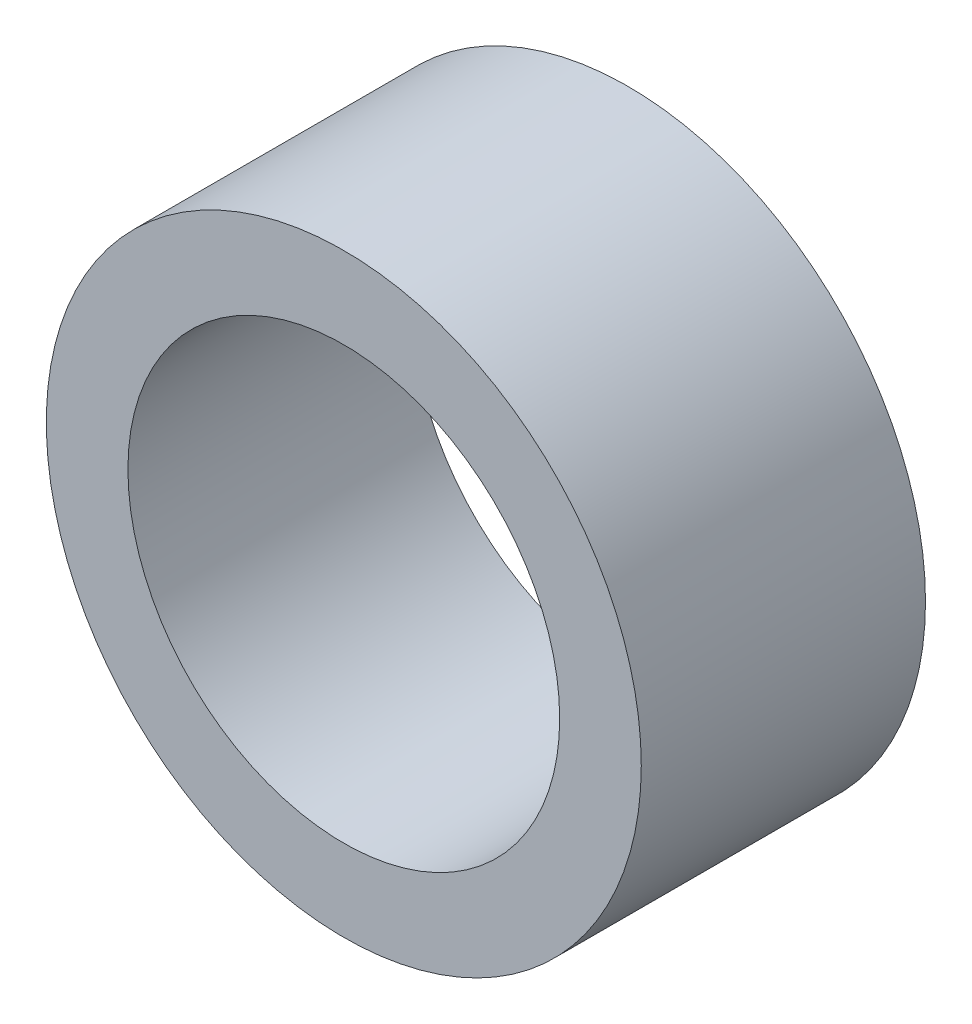
ISO-10303-21;
HEADER;
FILE_DESCRIPTION(('STEP AP214'),'2;1');
FILE_NAME('part.step','',(''),(''),'','','');
FILE_SCHEMA(('AUTOMOTIVE_DESIGN { 1 0 10303 214 1 1 1 1 }'));
ENDSEC;
DATA;
#1=APPLICATION_CONTEXT('core data for automotive mechanical design processes');
#2=APPLICATION_PROTOCOL_DEFINITION('international standard','automotive_design',2000,#1);
#3=PRODUCT_CONTEXT('',#1,'mechanical');
#4=PRODUCT('Part','Part','',(#3));
#5=PRODUCT_RELATED_PRODUCT_CATEGORY('part','',(#4));
#6=PRODUCT_DEFINITION_FORMATION('','',#4);
#7=PRODUCT_DEFINITION_CONTEXT('part definition',#1,'design');
#8=PRODUCT_DEFINITION('design','',#6,#7);
#9=PRODUCT_DEFINITION_SHAPE('','',#8);
#10=(LENGTH_UNIT() NAMED_UNIT(*) SI_UNIT(.MILLI.,.METRE.));
#11=(NAMED_UNIT(*) PLANE_ANGLE_UNIT() SI_UNIT($,.RADIAN.));
#12=(NAMED_UNIT(*) SI_UNIT($,.STERADIAN.) SOLID_ANGLE_UNIT());
#13=UNCERTAINTY_MEASURE_WITH_UNIT(LENGTH_MEASURE(1.E-05),#10,'distance_accuracy_value','');
#14=(GEOMETRIC_REPRESENTATION_CONTEXT(3) GLOBAL_UNCERTAINTY_ASSIGNED_CONTEXT((#13)) GLOBAL_UNIT_ASSIGNED_CONTEXT((#10,
#11,#12)) REPRESENTATION_CONTEXT('',''));
#15=CARTESIAN_POINT('',(0.,0.,0.));
#16=DIRECTION('',(0.,0.,1.));
#17=DIRECTION('',(1.,0.,0.));
#18=AXIS2_PLACEMENT_3D('',#15,#16,#17);
#19=CARTESIAN_POINT('',(0.,0.,5.3086));
#20=DIRECTION('',(0.,0.,1.));
#21=DIRECTION('',(1.,0.,0.));
#22=AXIS2_PLACEMENT_3D('',#19,#20,#21);
#23=PLANE('',#22);
#24=CARTESIAN_POINT('',(0.,0.,5.3086));
#25=DIRECTION('',(0.,0.,1.));
#26=DIRECTION('',(1.,0.,0.));
#27=AXIS2_PLACEMENT_3D('',#24,#25,#26);
#28=CIRCLE('',#27,11.1125);
#29=CARTESIAN_POINT('',(11.1125,0.,5.3086));
#30=VERTEX_POINT('',#29);
#31=EDGE_CURVE('E10',#30,#30,#28,.T.);
#32=ORIENTED_EDGE('',*,*,#31,.T.);
#33=EDGE_LOOP('',(#32));
#34=FACE_BOUND('',#33,.T.);
#35=CARTESIAN_POINT('',(0.,0.,5.3086));
#36=DIRECTION('',(0.,0.,1.));
#37=DIRECTION('',(1.,0.,0.));
#38=AXIS2_PLACEMENT_3D('',#35,#36,#37);
#39=CIRCLE('',#38,8.0645);
#40=CARTESIAN_POINT('',(8.0645,0.,5.3086));
#41=VERTEX_POINT('',#40);
#42=EDGE_CURVE('E41',#41,#41,#39,.T.);
#43=ORIENTED_EDGE('',*,*,#42,.F.);
#44=EDGE_LOOP('',(#43));
#45=FACE_BOUND('',#44,.T.);
#46=ADVANCED_FACE('F30',(#34,#45),#23,.T.);
#47=CARTESIAN_POINT('',(0.,0.,-5.3086));
#48=DIRECTION('',(0.,0.,1.));
#49=DIRECTION('',(1.,0.,0.));
#50=AXIS2_PLACEMENT_3D('',#47,#48,#49);
#51=PLANE('',#50);
#52=CARTESIAN_POINT('',(0.,0.,-5.3086));
#53=DIRECTION('',(0.,0.,1.));
#54=DIRECTION('',(1.,0.,0.));
#55=AXIS2_PLACEMENT_3D('',#52,#53,#54);
#56=CIRCLE('',#55,11.1125);
#57=CARTESIAN_POINT('',(11.1125,0.,-5.3086));
#58=VERTEX_POINT('',#57);
#59=EDGE_CURVE('E34',#58,#58,#56,.T.);
#60=ORIENTED_EDGE('',*,*,#59,.F.);
#61=EDGE_LOOP('',(#60));
#62=FACE_BOUND('',#61,.T.);
#63=CARTESIAN_POINT('',(0.,0.,-5.3086));
#64=DIRECTION('',(0.,0.,1.));
#65=DIRECTION('',(1.,0.,0.));
#66=AXIS2_PLACEMENT_3D('',#63,#64,#65);
#67=CIRCLE('',#66,8.0645);
#68=CARTESIAN_POINT('',(8.0645,0.,-5.3086));
#69=VERTEX_POINT('',#68);
#70=EDGE_CURVE('E43',#69,#69,#67,.T.);
#71=ORIENTED_EDGE('',*,*,#70,.T.);
#72=EDGE_LOOP('',(#71));
#73=FACE_BOUND('',#72,.T.);
#74=ADVANCED_FACE('F53',(#62,#73),#51,.F.);
#75=CARTESIAN_POINT('',(0.,0.,5.3086));
#76=DIRECTION('',(0.,0.,-1.));
#77=DIRECTION('',(-1.,0.,0.));
#78=AXIS2_PLACEMENT_3D('',#75,#76,#77);
#79=CYLINDRICAL_SURFACE('',#78,11.1125);
#80=ORIENTED_EDGE('',*,*,#31,.F.);
#81=EDGE_LOOP('',(#80));
#82=FACE_BOUND('',#81,.T.);
#83=ORIENTED_EDGE('',*,*,#59,.T.);
#84=EDGE_LOOP('',(#83));
#85=FACE_BOUND('',#84,.T.);
#86=ADVANCED_FACE('F32',(#82,#85),#79,.T.);
#87=CARTESIAN_POINT('',(0.,0.,5.3086));
#88=DIRECTION('',(0.,0.,-1.));
#89=DIRECTION('',(-1.,0.,0.));
#90=AXIS2_PLACEMENT_3D('',#87,#88,#89);
#91=CYLINDRICAL_SURFACE('',#90,8.0645);
#92=ORIENTED_EDGE('',*,*,#42,.T.);
#93=EDGE_LOOP('',(#92));
#94=FACE_BOUND('',#93,.T.);
#95=ORIENTED_EDGE('',*,*,#70,.F.);
#96=EDGE_LOOP('',(#95));
#97=FACE_BOUND('',#96,.T.);
#98=ADVANCED_FACE('F49',(#94,#97),#91,.F.);
#99=CLOSED_SHELL('',(#46,#74,#86,#98));
#100=MANIFOLD_SOLID_BREP('B2',#99);
#101=ADVANCED_BREP_SHAPE_REPRESENTATION('',(#18,#100),#14);
#102=SHAPE_DEFINITION_REPRESENTATION(#9,#101);
ENDSEC;
END-ISO-10303-21;
